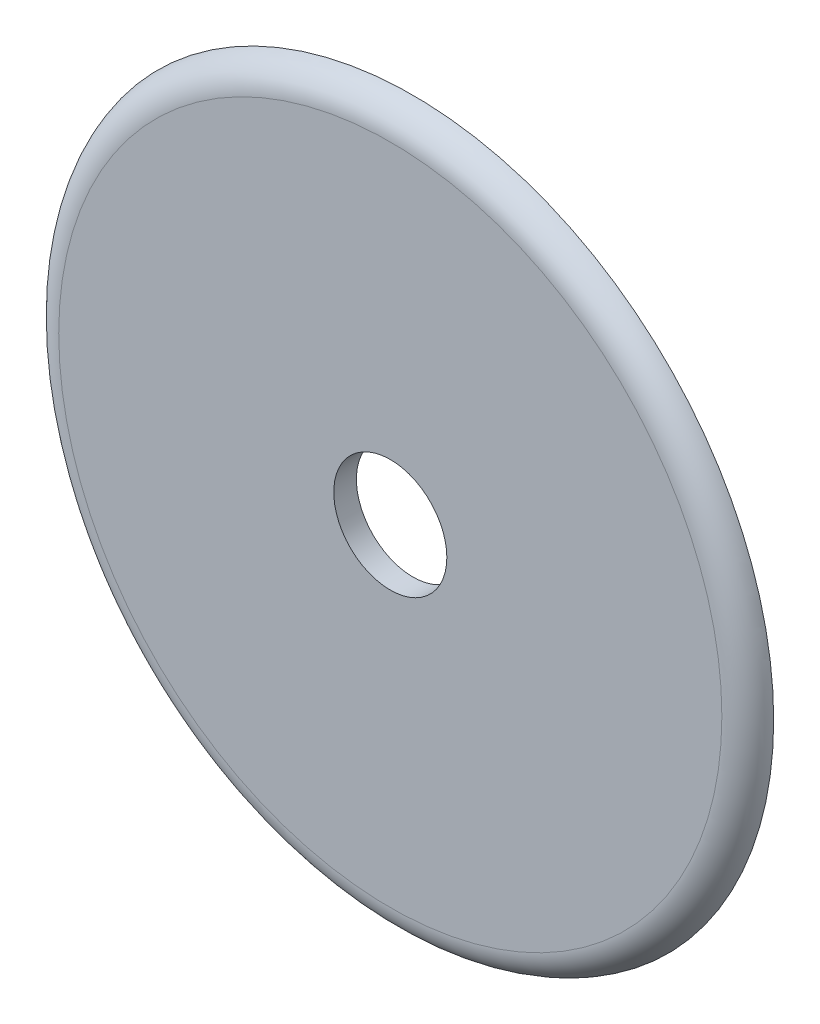
ISO-10303-21;
HEADER;
FILE_DESCRIPTION(('STEP AP214'),'2;1');
FILE_NAME('part.step','',(''),(''),'','','');
FILE_SCHEMA(('AUTOMOTIVE_DESIGN { 1 0 10303 214 1 1 1 1 }'));
ENDSEC;
DATA;
#1=APPLICATION_CONTEXT('core data for automotive mechanical design processes');
#2=APPLICATION_PROTOCOL_DEFINITION('international standard','automotive_design',2000,#1);
#3=PRODUCT_CONTEXT('',#1,'mechanical');
#4=PRODUCT('Part','Part','',(#3));
#5=PRODUCT_RELATED_PRODUCT_CATEGORY('part','',(#4));
#6=PRODUCT_DEFINITION_FORMATION('','',#4);
#7=PRODUCT_DEFINITION_CONTEXT('part definition',#1,'design');
#8=PRODUCT_DEFINITION('design','',#6,#7);
#9=PRODUCT_DEFINITION_SHAPE('','',#8);
#10=(LENGTH_UNIT() NAMED_UNIT(*) SI_UNIT(.MILLI.,.METRE.));
#11=(NAMED_UNIT(*) PLANE_ANGLE_UNIT() SI_UNIT($,.RADIAN.));
#12=(NAMED_UNIT(*) SI_UNIT($,.STERADIAN.) SOLID_ANGLE_UNIT());
#13=UNCERTAINTY_MEASURE_WITH_UNIT(LENGTH_MEASURE(1.E-05),#10,'distance_accuracy_value','');
#14=(GEOMETRIC_REPRESENTATION_CONTEXT(3) GLOBAL_UNCERTAINTY_ASSIGNED_CONTEXT((#13)) GLOBAL_UNIT_ASSIGNED_CONTEXT((#10,
#11,#12)) REPRESENTATION_CONTEXT('',''));
#15=CARTESIAN_POINT('',(0.,0.,0.));
#16=DIRECTION('',(0.,0.,1.));
#17=DIRECTION('',(1.,0.,0.));
#18=AXIS2_PLACEMENT_3D('',#15,#16,#17);
#19=CARTESIAN_POINT('',(0.,0.,3.));
#20=DIRECTION('',(0.,0.,1.));
#21=DIRECTION('',(1.,0.,0.));
#22=AXIS2_PLACEMENT_3D('',#19,#20,#21);
#23=PLANE('',#22);
#24=CARTESIAN_POINT('',(0.,0.,3.));
#25=DIRECTION('',(0.,0.,1.));
#26=DIRECTION('',(1.,0.,0.));
#27=AXIS2_PLACEMENT_3D('',#24,#25,#26);
#28=CIRCLE('',#27,43.9770166537926);
#29=CARTESIAN_POINT('',(43.9770166537926,0.,3.));
#30=VERTEX_POINT('',#29);
#31=EDGE_CURVE('E10',#30,#30,#28,.T.);
#32=ORIENTED_EDGE('',*,*,#31,.T.);
#33=EDGE_LOOP('',(#32));
#34=FACE_BOUND('',#33,.T.);
#35=CARTESIAN_POINT('',(0.,0.,3.));
#36=DIRECTION('',(0.,0.,1.));
#37=DIRECTION('',(1.,0.,0.));
#38=AXIS2_PLACEMENT_3D('',#35,#36,#37);
#39=CIRCLE('',#38,7.5);
#40=CARTESIAN_POINT('',(7.5,0.,3.));
#41=VERTEX_POINT('',#40);
#42=EDGE_CURVE('E50',#41,#41,#39,.T.);
#43=ORIENTED_EDGE('',*,*,#42,.F.);
#44=EDGE_LOOP('',(#43));
#45=FACE_BOUND('',#44,.T.);
#46=ADVANCED_FACE('F34',(#34,#45),#23,.T.);
#47=CARTESIAN_POINT('',(0.,0.,0.));
#48=DIRECTION('',(0.,0.,1.));
#49=DIRECTION('',(1.,0.,0.));
#50=AXIS2_PLACEMENT_3D('',#47,#48,#49);
#51=PLANE('',#50);
#52=CARTESIAN_POINT('',(0.,0.,0.));
#53=DIRECTION('',(0.,0.,1.));
#54=DIRECTION('',(1.,0.,0.));
#55=AXIS2_PLACEMENT_3D('',#52,#53,#54);
#56=CIRCLE('',#55,7.5);
#57=CARTESIAN_POINT('',(7.5,0.,0.));
#58=VERTEX_POINT('',#57);
#59=EDGE_CURVE('E45',#58,#58,#56,.T.);
#60=ORIENTED_EDGE('',*,*,#59,.T.);
#61=EDGE_LOOP('',(#60));
#62=FACE_BOUND('',#61,.T.);
#63=CARTESIAN_POINT('',(0.,0.,0.));
#64=DIRECTION('',(0.,0.,1.));
#65=DIRECTION('',(1.,0.,0.));
#66=AXIS2_PLACEMENT_3D('',#63,#64,#65);
#67=CIRCLE('',#66,47.85);
#68=CARTESIAN_POINT('',(47.85,0.,0.));
#69=VERTEX_POINT('',#68);
#70=EDGE_CURVE('E41',#69,#69,#67,.T.);
#71=ORIENTED_EDGE('',*,*,#70,.F.);
#72=EDGE_LOOP('',(#71));
#73=FACE_BOUND('',#72,.T.);
#74=ADVANCED_FACE('F59',(#62,#73),#51,.F.);
#75=CARTESIAN_POINT('',(0.,0.,-3.));
#76=DIRECTION('',(0.,0.,1.));
#77=DIRECTION('',(1.,0.,0.));
#78=AXIS2_PLACEMENT_3D('',#75,#76,#77);
#79=CYLINDRICAL_SURFACE('',#78,7.5);
#80=ORIENTED_EDGE('',*,*,#42,.T.);
#81=EDGE_LOOP('',(#80));
#82=FACE_BOUND('',#81,.T.);
#83=ORIENTED_EDGE('',*,*,#59,.F.);
#84=EDGE_LOOP('',(#83));
#85=FACE_BOUND('',#84,.T.);
#86=ADVANCED_FACE('F55',(#82,#85),#79,.F.);
#87=CARTESIAN_POINT('',(0.,0.,-1.));
#88=DIRECTION('',(0.,0.,-1.));
#89=DIRECTION('',(-1.,0.,0.));
#90=AXIS2_PLACEMENT_3D('',#87,#88,#89);
#91=TOROIDAL_SURFACE('',#90,43.9770166537926,4.);
#92=ORIENTED_EDGE('',*,*,#70,.T.);
#93=EDGE_LOOP('',(#92));
#94=FACE_BOUND('',#93,.T.);
#95=ORIENTED_EDGE('',*,*,#31,.F.);
#96=EDGE_LOOP('',(#95));
#97=FACE_BOUND('',#96,.T.);
#98=ADVANCED_FACE('F36',(#94,#97),#91,.T.);
#99=CLOSED_SHELL('',(#46,#74,#86,#98));
#100=MANIFOLD_SOLID_BREP('B2',#99);
#101=ADVANCED_BREP_SHAPE_REPRESENTATION('',(#18,#100),#14);
#102=SHAPE_DEFINITION_REPRESENTATION(#9,#101);
ENDSEC;
END-ISO-10303-21;
